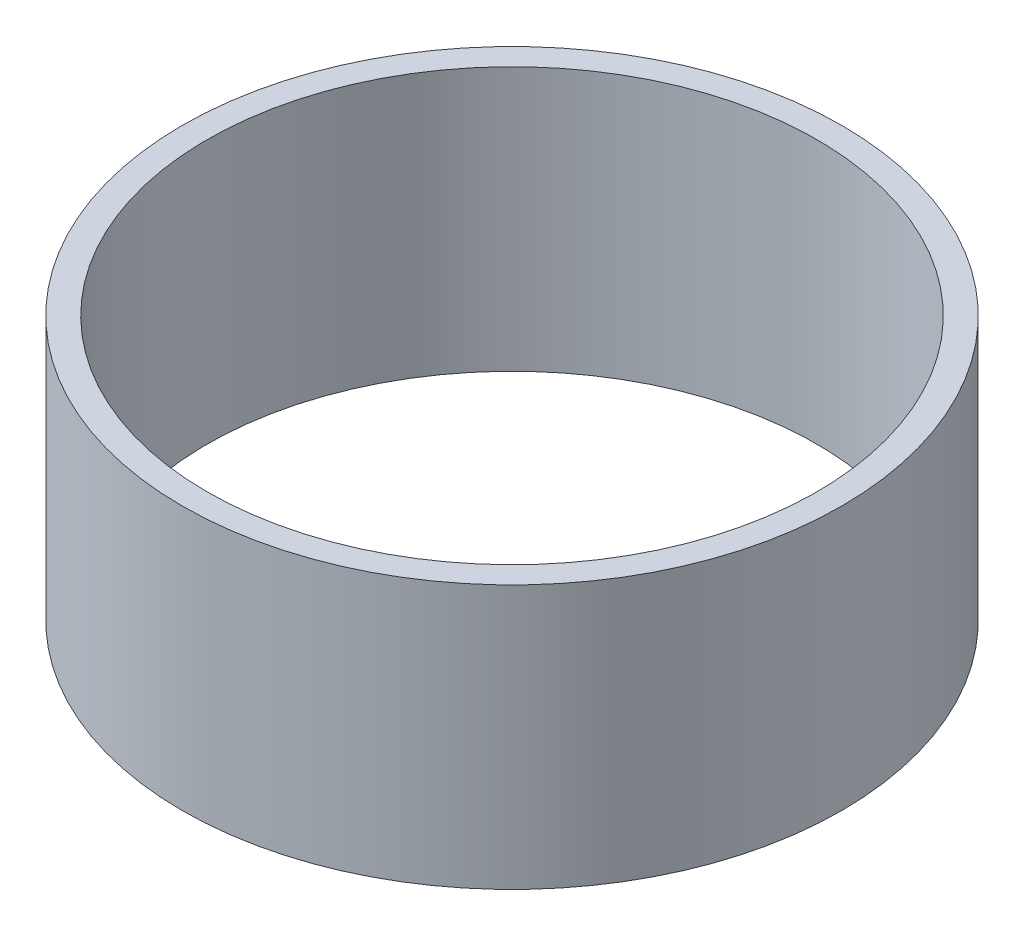
ISO-10303-21;
HEADER;
FILE_DESCRIPTION(('STEP AP214'),'2;1');
FILE_NAME('part.step','',(''),(''),'','','');
FILE_SCHEMA(('AUTOMOTIVE_DESIGN { 1 0 10303 214 1 1 1 1 }'));
ENDSEC;
DATA;
#1=APPLICATION_CONTEXT('core data for automotive mechanical design processes');
#2=APPLICATION_PROTOCOL_DEFINITION('international standard','automotive_design',2000,#1);
#3=PRODUCT_CONTEXT('',#1,'mechanical');
#4=PRODUCT('Part','Part','',(#3));
#5=PRODUCT_RELATED_PRODUCT_CATEGORY('part','',(#4));
#6=PRODUCT_DEFINITION_FORMATION('','',#4);
#7=PRODUCT_DEFINITION_CONTEXT('part definition',#1,'design');
#8=PRODUCT_DEFINITION('design','',#6,#7);
#9=PRODUCT_DEFINITION_SHAPE('','',#8);
#10=(LENGTH_UNIT() NAMED_UNIT(*) SI_UNIT(.MILLI.,.METRE.));
#11=(NAMED_UNIT(*) PLANE_ANGLE_UNIT() SI_UNIT($,.RADIAN.));
#12=(NAMED_UNIT(*) SI_UNIT($,.STERADIAN.) SOLID_ANGLE_UNIT());
#13=UNCERTAINTY_MEASURE_WITH_UNIT(LENGTH_MEASURE(1.E-05),#10,'distance_accuracy_value','');
#14=(GEOMETRIC_REPRESENTATION_CONTEXT(3) GLOBAL_UNCERTAINTY_ASSIGNED_CONTEXT((#13)) GLOBAL_UNIT_ASSIGNED_CONTEXT((#10,
#11,#12)) REPRESENTATION_CONTEXT('',''));
#15=CARTESIAN_POINT('',(0.,0.,0.));
#16=DIRECTION('',(0.,0.,1.));
#17=DIRECTION('',(1.,0.,0.));
#18=AXIS2_PLACEMENT_3D('',#15,#16,#17);
#19=CARTESIAN_POINT('',(0.,50.8,0.));
#20=DIRECTION('',(0.,1.,0.));
#21=DIRECTION('',(0.,0.,1.));
#22=AXIS2_PLACEMENT_3D('',#19,#20,#21);
#23=PLANE('',#22);
#24=CARTESIAN_POINT('',(0.,50.8,0.));
#25=DIRECTION('',(0.,1.,0.));
#26=DIRECTION('',(0.,0.,1.));
#27=AXIS2_PLACEMENT_3D('',#24,#25,#26);
#28=CIRCLE('',#27,63.5);
#29=CARTESIAN_POINT('',(0.,50.8,63.5));
#30=VERTEX_POINT('',#29);
#31=EDGE_CURVE('E10',#30,#30,#28,.T.);
#32=ORIENTED_EDGE('',*,*,#31,.T.);
#33=EDGE_LOOP('',(#32));
#34=FACE_BOUND('',#33,.T.);
#35=CARTESIAN_POINT('',(0.,50.8,0.));
#36=DIRECTION('',(0.,1.,0.));
#37=DIRECTION('',(0.,0.,1.));
#38=AXIS2_PLACEMENT_3D('',#35,#36,#37);
#39=CIRCLE('',#38,58.7375);
#40=CARTESIAN_POINT('',(0.,50.8,58.7375));
#41=VERTEX_POINT('',#40);
#42=EDGE_CURVE('E43',#41,#41,#39,.T.);
#43=ORIENTED_EDGE('',*,*,#42,.F.);
#44=EDGE_LOOP('',(#43));
#45=FACE_BOUND('',#44,.T.);
#46=ADVANCED_FACE('F32',(#34,#45),#23,.T.);
#47=CARTESIAN_POINT('',(0.,0.,0.));
#48=DIRECTION('',(0.,1.,0.));
#49=DIRECTION('',(0.,0.,1.));
#50=AXIS2_PLACEMENT_3D('',#47,#48,#49);
#51=PLANE('',#50);
#52=CARTESIAN_POINT('',(0.,0.,0.));
#53=DIRECTION('',(0.,1.,0.));
#54=DIRECTION('',(0.,0.,1.));
#55=AXIS2_PLACEMENT_3D('',#52,#53,#54);
#56=CIRCLE('',#55,63.5);
#57=CARTESIAN_POINT('',(0.,0.,63.5));
#58=VERTEX_POINT('',#57);
#59=EDGE_CURVE('E39',#58,#58,#56,.T.);
#60=ORIENTED_EDGE('',*,*,#59,.F.);
#61=EDGE_LOOP('',(#60));
#62=FACE_BOUND('',#61,.T.);
#63=CARTESIAN_POINT('',(0.,0.,0.));
#64=DIRECTION('',(0.,1.,0.));
#65=DIRECTION('',(0.,0.,1.));
#66=AXIS2_PLACEMENT_3D('',#63,#64,#65);
#67=CIRCLE('',#66,58.7375);
#68=CARTESIAN_POINT('',(0.,0.,58.7375));
#69=VERTEX_POINT('',#68);
#70=EDGE_CURVE('E47',#69,#69,#67,.T.);
#71=ORIENTED_EDGE('',*,*,#70,.T.);
#72=EDGE_LOOP('',(#71));
#73=FACE_BOUND('',#72,.T.);
#74=ADVANCED_FACE('F53',(#62,#73),#51,.F.);
#75=CARTESIAN_POINT('',(0.,50.8,0.));
#76=DIRECTION('',(0.,-1.,0.));
#77=DIRECTION('',(0.,0.,-1.));
#78=AXIS2_PLACEMENT_3D('',#75,#76,#77);
#79=CYLINDRICAL_SURFACE('',#78,63.5);
#80=ORIENTED_EDGE('',*,*,#31,.F.);
#81=EDGE_LOOP('',(#80));
#82=FACE_BOUND('',#81,.T.);
#83=ORIENTED_EDGE('',*,*,#59,.T.);
#84=EDGE_LOOP('',(#83));
#85=FACE_BOUND('',#84,.T.);
#86=ADVANCED_FACE('F34',(#82,#85),#79,.T.);
#87=CARTESIAN_POINT('',(0.,50.8,0.));
#88=DIRECTION('',(0.,-1.,0.));
#89=DIRECTION('',(0.,0.,-1.));
#90=AXIS2_PLACEMENT_3D('',#87,#88,#89);
#91=CYLINDRICAL_SURFACE('',#90,58.7375);
#92=ORIENTED_EDGE('',*,*,#42,.T.);
#93=EDGE_LOOP('',(#92));
#94=FACE_BOUND('',#93,.T.);
#95=ORIENTED_EDGE('',*,*,#70,.F.);
#96=EDGE_LOOP('',(#95));
#97=FACE_BOUND('',#96,.T.);
#98=ADVANCED_FACE('F55',(#94,#97),#91,.F.);
#99=CLOSED_SHELL('',(#46,#74,#86,#98));
#100=MANIFOLD_SOLID_BREP('B2',#99);
#101=ADVANCED_BREP_SHAPE_REPRESENTATION('',(#18,#100),#14);
#102=SHAPE_DEFINITION_REPRESENTATION(#9,#101);
ENDSEC;
END-ISO-10303-21;
